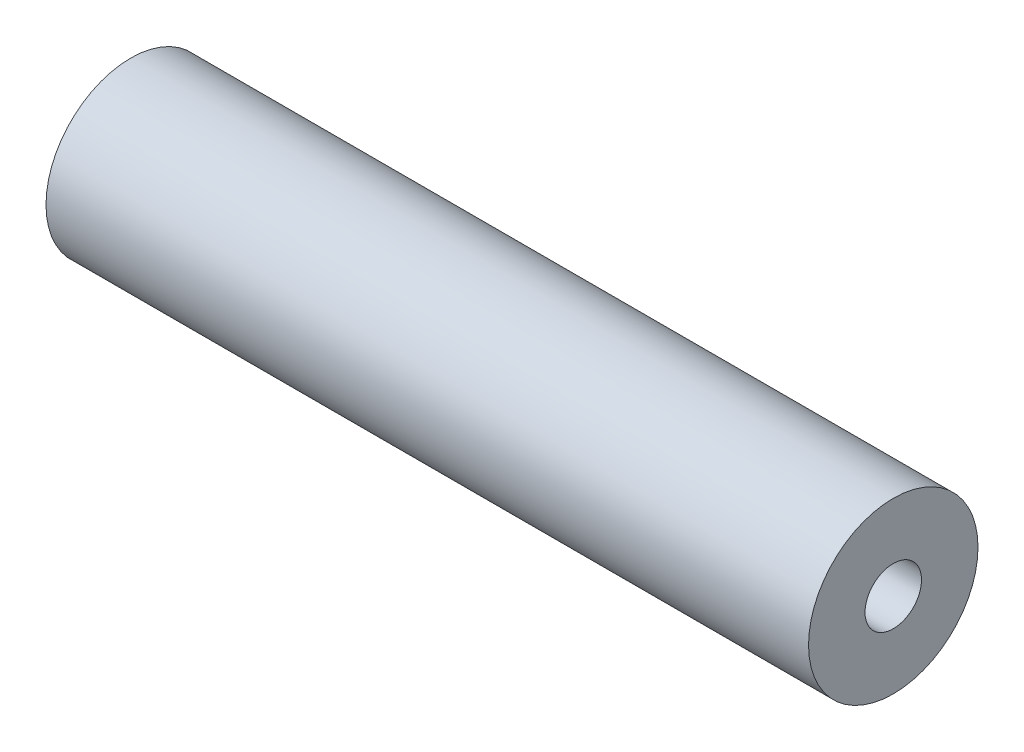
ISO-10303-21;
HEADER;
FILE_DESCRIPTION(('STEP AP214'),'2;1');
FILE_NAME('part.step','',(''),(''),'','','');
FILE_SCHEMA(('AUTOMOTIVE_DESIGN { 1 0 10303 214 1 1 1 1 }'));
ENDSEC;
DATA;
#1=APPLICATION_CONTEXT('core data for automotive mechanical design processes');
#2=APPLICATION_PROTOCOL_DEFINITION('international standard','automotive_design',2000,#1);
#3=PRODUCT_CONTEXT('',#1,'mechanical');
#4=PRODUCT('Part','Part','',(#3));
#5=PRODUCT_RELATED_PRODUCT_CATEGORY('part','',(#4));
#6=PRODUCT_DEFINITION_FORMATION('','',#4);
#7=PRODUCT_DEFINITION_CONTEXT('part definition',#1,'design');
#8=PRODUCT_DEFINITION('design','',#6,#7);
#9=PRODUCT_DEFINITION_SHAPE('','',#8);
#10=(LENGTH_UNIT() NAMED_UNIT(*) SI_UNIT(.MILLI.,.METRE.));
#11=(NAMED_UNIT(*) PLANE_ANGLE_UNIT() SI_UNIT($,.RADIAN.));
#12=(NAMED_UNIT(*) SI_UNIT($,.STERADIAN.) SOLID_ANGLE_UNIT());
#13=UNCERTAINTY_MEASURE_WITH_UNIT(LENGTH_MEASURE(1.E-05),#10,'distance_accuracy_value','');
#14=(GEOMETRIC_REPRESENTATION_CONTEXT(3) GLOBAL_UNCERTAINTY_ASSIGNED_CONTEXT((#13)) GLOBAL_UNIT_ASSIGNED_CONTEXT((#10,
#11,#12)) REPRESENTATION_CONTEXT('',''));
#15=CARTESIAN_POINT('',(0.,0.,0.));
#16=DIRECTION('',(0.,0.,1.));
#17=DIRECTION('',(1.,0.,0.));
#18=AXIS2_PLACEMENT_3D('',#15,#16,#17);
#19=CARTESIAN_POINT('',(54.0000545606497,0.,0.));
#20=DIRECTION('',(-1.,0.,0.));
#21=DIRECTION('',(0.,0.,1.));
#22=AXIS2_PLACEMENT_3D('',#19,#20,#21);
#23=CYLINDRICAL_SURFACE('',#22,6.);
#24=CARTESIAN_POINT('',(54.0000545606497,0.,0.));
#25=DIRECTION('',(1.,0.,0.));
#26=DIRECTION('',(0.,0.,-1.));
#27=AXIS2_PLACEMENT_3D('',#24,#25,#26);
#28=CIRCLE('',#27,6.);
#29=CARTESIAN_POINT('',(54.0000545606497,0.,-6.));
#30=VERTEX_POINT('',#29);
#31=EDGE_CURVE('E10',#30,#30,#28,.T.);
#32=ORIENTED_EDGE('',*,*,#31,.F.);
#33=EDGE_LOOP('',(#32));
#34=FACE_BOUND('',#33,.T.);
#35=CARTESIAN_POINT('',(0.,0.,0.));
#36=DIRECTION('',(1.,0.,0.));
#37=DIRECTION('',(0.,0.,-1.));
#38=AXIS2_PLACEMENT_3D('',#35,#36,#37);
#39=CIRCLE('',#38,6.);
#40=CARTESIAN_POINT('',(0.,0.,-6.));
#41=VERTEX_POINT('',#40);
#42=EDGE_CURVE('E35',#41,#41,#39,.T.);
#43=ORIENTED_EDGE('',*,*,#42,.T.);
#44=EDGE_LOOP('',(#43));
#45=FACE_BOUND('',#44,.T.);
#46=ADVANCED_FACE('F32',(#34,#45),#23,.T.);
#47=CARTESIAN_POINT('',(54.0000545606497,0.,0.));
#48=DIRECTION('',(1.,0.,0.));
#49=DIRECTION('',(0.,0.,-1.));
#50=AXIS2_PLACEMENT_3D('',#47,#48,#49);
#51=PLANE('',#50);
#52=CARTESIAN_POINT('',(54.0000545606497,0.,0.));
#53=DIRECTION('',(-1.,0.,0.));
#54=DIRECTION('',(0.,0.,1.));
#55=AXIS2_PLACEMENT_3D('',#52,#53,#54);
#56=CIRCLE('',#55,2.);
#57=CARTESIAN_POINT('',(54.0000545606497,0.,2.));
#58=VERTEX_POINT('',#57);
#59=EDGE_CURVE('E42',#58,#58,#56,.T.);
#60=ORIENTED_EDGE('',*,*,#59,.T.);
#61=EDGE_LOOP('',(#60));
#62=FACE_BOUND('',#61,.T.);
#63=ORIENTED_EDGE('',*,*,#31,.T.);
#64=EDGE_LOOP('',(#63));
#65=FACE_BOUND('',#64,.T.);
#66=ADVANCED_FACE('F50',(#62,#65),#51,.T.);
#67=CARTESIAN_POINT('',(0.,0.,0.));
#68=DIRECTION('',(1.,0.,0.));
#69=DIRECTION('',(0.,0.,-1.));
#70=AXIS2_PLACEMENT_3D('',#67,#68,#69);
#71=PLANE('',#70);
#72=CARTESIAN_POINT('',(0.,0.,0.));
#73=DIRECTION('',(-1.,0.,0.));
#74=DIRECTION('',(0.,0.,1.));
#75=AXIS2_PLACEMENT_3D('',#72,#73,#74);
#76=CIRCLE('',#75,2.);
#77=CARTESIAN_POINT('',(0.,0.,2.));
#78=VERTEX_POINT('',#77);
#79=EDGE_CURVE('E44',#78,#78,#76,.T.);
#80=ORIENTED_EDGE('',*,*,#79,.F.);
#81=EDGE_LOOP('',(#80));
#82=FACE_BOUND('',#81,.T.);
#83=ORIENTED_EDGE('',*,*,#42,.F.);
#84=EDGE_LOOP('',(#83));
#85=FACE_BOUND('',#84,.T.);
#86=ADVANCED_FACE('F55',(#82,#85),#71,.F.);
#87=CARTESIAN_POINT('',(54.0000545606497,0.,0.));
#88=DIRECTION('',(-1.,0.,0.));
#89=DIRECTION('',(0.,0.,1.));
#90=AXIS2_PLACEMENT_3D('',#87,#88,#89);
#91=CYLINDRICAL_SURFACE('',#90,2.);
#92=ORIENTED_EDGE('',*,*,#59,.F.);
#93=EDGE_LOOP('',(#92));
#94=FACE_BOUND('',#93,.T.);
#95=ORIENTED_EDGE('',*,*,#79,.T.);
#96=EDGE_LOOP('',(#95));
#97=FACE_BOUND('',#96,.T.);
#98=ADVANCED_FACE('F52',(#94,#97),#91,.F.);
#99=CLOSED_SHELL('',(#46,#66,#86,#98));
#100=MANIFOLD_SOLID_BREP('B2',#99);
#101=ADVANCED_BREP_SHAPE_REPRESENTATION('',(#18,#100),#14);
#102=SHAPE_DEFINITION_REPRESENTATION(#9,#101);
ENDSEC;
END-ISO-10303-21;
